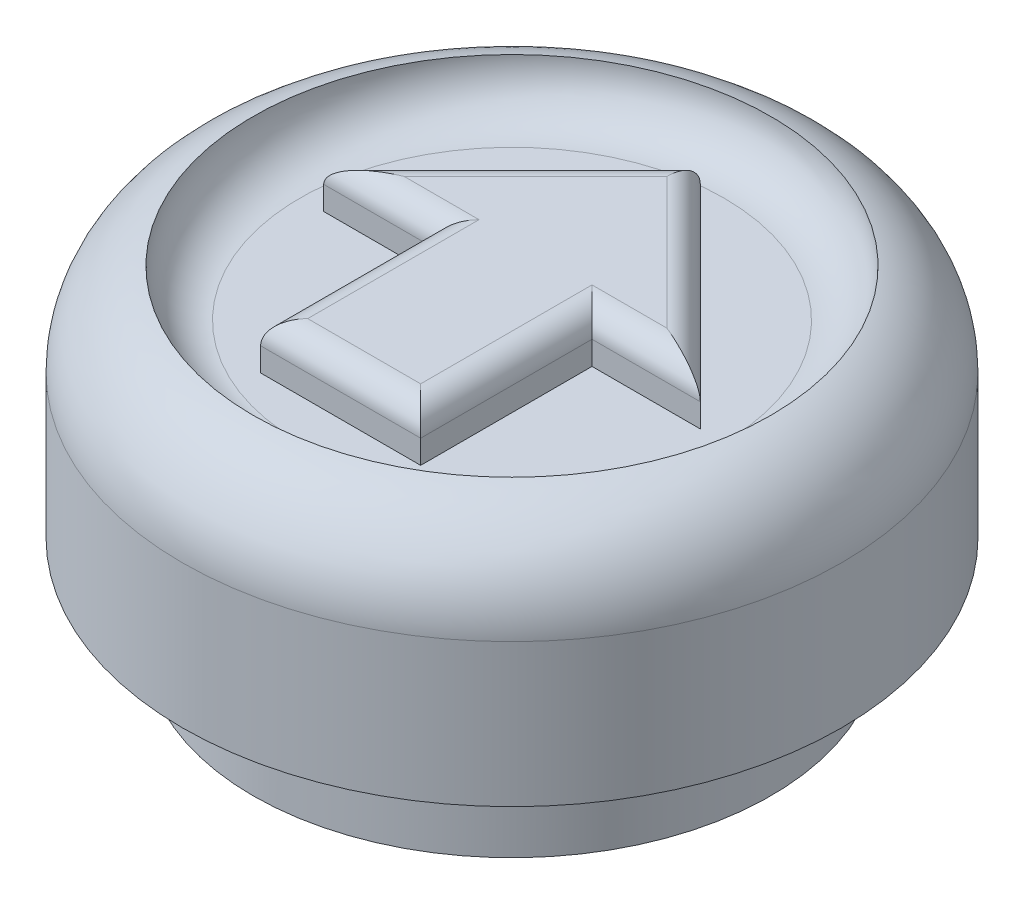
ISO-10303-21;
HEADER;
FILE_DESCRIPTION(('STEP AP214'),'2;1');
FILE_NAME('part.step','',(''),(''),'','','');
FILE_SCHEMA(('AUTOMOTIVE_DESIGN { 1 0 10303 214 1 1 1 1 }'));
ENDSEC;
DATA;
#1=APPLICATION_CONTEXT('core data for automotive mechanical design processes');
#2=APPLICATION_PROTOCOL_DEFINITION('international standard','automotive_design',2000,#1);
#3=PRODUCT_CONTEXT('',#1,'mechanical');
#4=PRODUCT('Part','Part','',(#3));
#5=PRODUCT_RELATED_PRODUCT_CATEGORY('part','',(#4));
#6=PRODUCT_DEFINITION_FORMATION('','',#4);
#7=PRODUCT_DEFINITION_CONTEXT('part definition',#1,'design');
#8=PRODUCT_DEFINITION('design','',#6,#7);
#9=PRODUCT_DEFINITION_SHAPE('','',#8);
#10=(LENGTH_UNIT() NAMED_UNIT(*) SI_UNIT(.MILLI.,.METRE.));
#11=(NAMED_UNIT(*) PLANE_ANGLE_UNIT() SI_UNIT($,.RADIAN.));
#12=(NAMED_UNIT(*) SI_UNIT($,.STERADIAN.) SOLID_ANGLE_UNIT());
#13=UNCERTAINTY_MEASURE_WITH_UNIT(LENGTH_MEASURE(1.E-05),#10,'distance_accuracy_value','');
#14=(GEOMETRIC_REPRESENTATION_CONTEXT(3) GLOBAL_UNCERTAINTY_ASSIGNED_CONTEXT((#13)) GLOBAL_UNIT_ASSIGNED_CONTEXT((#10,
#11,#12)) REPRESENTATION_CONTEXT('',''));
#15=CARTESIAN_POINT('',(0.,0.,0.));
#16=DIRECTION('',(0.,0.,1.));
#17=DIRECTION('',(1.,0.,0.));
#18=AXIS2_PLACEMENT_3D('',#15,#16,#17);
#19=CARTESIAN_POINT('',(0.,6.,0.));
#20=DIRECTION('',(0.,1.,0.));
#21=DIRECTION('',(0.,0.,1.));
#22=AXIS2_PLACEMENT_3D('',#19,#20,#21);
#23=PLANE('',#22);
#24=CARTESIAN_POINT('',(0.,6.,0.));
#25=DIRECTION('',(0.,1.,0.));
#26=DIRECTION('',(0.,0.,1.));
#27=AXIS2_PLACEMENT_3D('',#24,#25,#26);
#28=CIRCLE('',#27,4.5);
#29=CARTESIAN_POINT('',(0.,6.,4.5));
#30=VERTEX_POINT('',#29);
#31=EDGE_CURVE('E230',#30,#30,#28,.T.);
#32=ORIENTED_EDGE('',*,*,#31,.T.);
#33=EDGE_LOOP('',(#32));
#34=FACE_BOUND('',#33,.T.);
#35=DIRECTION('',(-0.707106781184056,0.,0.707106781189039));
#36=VECTOR('',#35,1.);
#37=CARTESIAN_POINT('',(0.,6.,-3.99999999999534));
#38=LINE('',#37,#36);
#39=CARTESIAN_POINT('',(0.,6.,-3.99999999999534));
#40=VERTEX_POINT('',#39);
#41=CARTESIAN_POINT('',(-3.99999999996716,6.,0.));
#42=VERTEX_POINT('',#41);
#43=EDGE_CURVE('E183',#40,#42,#38,.T.);
#44=ORIENTED_EDGE('',*,*,#43,.F.);
#45=DIRECTION('',(-0.707106781189039,0.,-0.707106781184056));
#46=VECTOR('',#45,1.);
#47=CARTESIAN_POINT('',(4.00000000002352,6.,0.));
#48=LINE('',#47,#46);
#49=CARTESIAN_POINT('',(4.00000000002352,6.,0.));
#50=VERTEX_POINT('',#49);
#51=EDGE_CURVE('E177',#50,#40,#48,.T.);
#52=ORIENTED_EDGE('',*,*,#51,.F.);
#53=DIRECTION('',(1.,0.,0.));
#54=VECTOR('',#53,1.);
#55=CARTESIAN_POINT('',(1.7,6.,0.));
#56=LINE('',#55,#54);
#57=CARTESIAN_POINT('',(1.7,6.,0.));
#58=VERTEX_POINT('',#57);
#59=EDGE_CURVE('E198',#58,#50,#56,.T.);
#60=ORIENTED_EDGE('',*,*,#59,.F.);
#61=DIRECTION('',(0.,0.,-1.));
#62=VECTOR('',#61,1.);
#63=CARTESIAN_POINT('',(1.7,6.,3.64010703583415));
#64=LINE('',#63,#62);
#65=CARTESIAN_POINT('',(1.7,6.,3.64010703583415));
#66=VERTEX_POINT('',#65);
#67=EDGE_CURVE('E195',#66,#58,#64,.T.);
#68=ORIENTED_EDGE('',*,*,#67,.F.);
#69=DIRECTION('',(1.,0.,0.));
#70=VECTOR('',#69,1.);
#71=CARTESIAN_POINT('',(-1.7,6.,3.64010703583417));
#72=LINE('',#71,#70);
#73=CARTESIAN_POINT('',(-1.7,6.,3.64010703583417));
#74=VERTEX_POINT('',#73);
#75=EDGE_CURVE('E192',#74,#66,#72,.T.);
#76=ORIENTED_EDGE('',*,*,#75,.F.);
#77=DIRECTION('',(0.,0.,1.));
#78=VECTOR('',#77,1.);
#79=CARTESIAN_POINT('',(-1.7,6.,0.));
#80=LINE('',#79,#78);
#81=CARTESIAN_POINT('',(-1.7,6.,0.));
#82=VERTEX_POINT('',#81);
#83=EDGE_CURVE('E189',#82,#74,#80,.T.);
#84=ORIENTED_EDGE('',*,*,#83,.F.);
#85=DIRECTION('',(1.,0.,0.));
#86=VECTOR('',#85,1.);
#87=CARTESIAN_POINT('',(-3.99999999996716,6.,0.));
#88=LINE('',#87,#86);
#89=EDGE_CURVE('E186',#42,#82,#88,.T.);
#90=ORIENTED_EDGE('',*,*,#89,.F.);
#91=EDGE_LOOP('',(#44,#52,#60,#68,#76,#84,#90));
#92=FACE_BOUND('',#91,.T.);
#93=ADVANCED_FACE('F33',(#34,#92),#23,.T.);
#94=CARTESIAN_POINT('',(0.,7.,0.));
#95=DIRECTION('',(0.,-1.,0.));
#96=DIRECTION('',(0.,0.,-1.));
#97=AXIS2_PLACEMENT_3D('',#94,#95,#96);
#98=CYLINDRICAL_SURFACE('',#97,5.5);
#99=CARTESIAN_POINT('',(0.,0.,0.));
#100=DIRECTION('',(0.,1.,0.));
#101=DIRECTION('',(0.,0.,1.));
#102=AXIS2_PLACEMENT_3D('',#99,#100,#101);
#103=CIRCLE('',#102,5.5);
#104=CARTESIAN_POINT('',(0.,0.,5.5));
#105=VERTEX_POINT('',#104);
#106=EDGE_CURVE('E224',#105,#105,#103,.T.);
#107=ORIENTED_EDGE('',*,*,#106,.T.);
#108=EDGE_LOOP('',(#107));
#109=FACE_BOUND('',#108,.T.);
#110=CARTESIAN_POINT('',(0.,2.00000000000002,0.));
#111=DIRECTION('',(0.,1.,0.));
#112=DIRECTION('',(-1.,0.,0.));
#113=AXIS2_PLACEMENT_3D('',#110,#111,#112);
#114=CIRCLE('',#113,5.5);
#115=CARTESIAN_POINT('',(-5.5,2.,0.));
#116=VERTEX_POINT('',#115);
#117=EDGE_CURVE('E227',#116,#116,#114,.T.);
#118=ORIENTED_EDGE('',*,*,#117,.F.);
#119=EDGE_LOOP('',(#118));
#120=FACE_BOUND('',#119,.T.);
#121=ADVANCED_FACE('F332',(#109,#120),#98,.T.);
#122=CARTESIAN_POINT('',(0.,0.,0.));
#123=DIRECTION('',(0.,1.,0.));
#124=DIRECTION('',(0.,0.,1.));
#125=AXIS2_PLACEMENT_3D('',#122,#123,#124);
#126=PLANE('',#125);
#127=DIRECTION('',(1.,0.,5.94468051171676E-13));
#128=VECTOR('',#127,1.);
#129=CARTESIAN_POINT('',(-2.00000000000628,0.,-2.00000000000715));
#130=LINE('',#129,#128);
#131=CARTESIAN_POINT('',(-2.00000000000628,0.,-2.00000000000715));
#132=VERTEX_POINT('',#131);
#133=CARTESIAN_POINT('',(2.00000000000803,0.,-2.00000000000477));
#134=VERTEX_POINT('',#133);
#135=EDGE_CURVE('E171',#132,#134,#130,.T.);
#136=ORIENTED_EDGE('',*,*,#135,.F.);
#137=DIRECTION('',(-8.11850586754725E-13,0.,-1.));
#138=VECTOR('',#137,1.);
#139=CARTESIAN_POINT('',(-2.00000000000628,0.,-2.00000000000715));
#140=LINE('',#139,#138);
#141=CARTESIAN_POINT('',(-2.00000000000303,0.,2.00000000000477));
#142=VERTEX_POINT('',#141);
#143=EDGE_CURVE('E145',#142,#132,#140,.T.);
#144=ORIENTED_EDGE('',*,*,#143,.F.);
#145=DIRECTION('',(-1.,0.,0.));
#146=VECTOR('',#145,1.);
#147=CARTESIAN_POINT('',(-2.00000000000303,0.,2.00000000000477));
#148=LINE('',#147,#146);
#149=CARTESIAN_POINT('',(2.00000000000652,0.,2.00000000000477));
#150=VERTEX_POINT('',#149);
#151=EDGE_CURVE('E162',#150,#142,#148,.T.);
#152=ORIENTED_EDGE('',*,*,#151,.F.);
#153=DIRECTION('',(-3.77085515589558E-13,0.,1.));
#154=VECTOR('',#153,1.);
#155=CARTESIAN_POINT('',(2.00000000000803,0.,-2.00000000000477));
#156=LINE('',#155,#154);
#157=EDGE_CURVE('E165',#134,#150,#156,.T.);
#158=ORIENTED_EDGE('',*,*,#157,.F.);
#159=EDGE_LOOP('',(#136,#144,#152,#158));
#160=FACE_BOUND('',#159,.T.);
#161=ORIENTED_EDGE('',*,*,#106,.F.);
#162=EDGE_LOOP('',(#161));
#163=FACE_BOUND('',#162,.T.);
#164=ADVANCED_FACE('F338',(#160,#163),#126,.F.);
#165=CARTESIAN_POINT('',(0.,5.03589838486559,0.));
#166=DIRECTION('',(0.,-1.,0.));
#167=DIRECTION('',(1.,0.,0.));
#168=AXIS2_PLACEMENT_3D('',#165,#166,#167);
#169=TOROIDAL_SURFACE('',#168,4.96410161513087,2.03589838486562);
#170=CARTESIAN_POINT('',(0.,5.0358983848704,0.));
#171=DIRECTION('',(0.,-1.,0.));
#172=DIRECTION('',(1.,0.,0.));
#173=AXIS2_PLACEMENT_3D('',#170,#171,#172);
#174=CIRCLE('',#173,6.99999999999649);
#175=CARTESIAN_POINT('',(6.99999999999647,5.03589838487042,0.));
#176=VERTEX_POINT('',#175);
#177=EDGE_CURVE('E218',#176,#176,#174,.T.);
#178=ORIENTED_EDGE('',*,*,#177,.F.);
#179=EDGE_LOOP('',(#178));
#180=FACE_BOUND('',#179,.T.);
#181=CARTESIAN_POINT('',(0.,7.,0.));
#182=DIRECTION('',(0.,1.,0.));
#183=DIRECTION('',(0.,0.,1.));
#184=AXIS2_PLACEMENT_3D('',#181,#182,#183);
#185=CIRCLE('',#184,5.5);
#186=CARTESIAN_POINT('',(0.,7.,5.5));
#187=VERTEX_POINT('',#186);
#188=EDGE_CURVE('E215',#187,#187,#185,.T.);
#189=ORIENTED_EDGE('',*,*,#188,.F.);
#190=EDGE_LOOP('',(#189));
#191=FACE_BOUND('',#190,.T.);
#192=ADVANCED_FACE('F352',(#180,#191),#169,.T.);
#193=CARTESIAN_POINT('',(-4.66523063482782,2.,0.));
#194=DIRECTION('',(0.,1.,0.));
#195=DIRECTION('',(-1.,0.,0.));
#196=AXIS2_PLACEMENT_3D('',#193,#194,#195);
#197=PLANE('',#196);
#198=ORIENTED_EDGE('',*,*,#117,.T.);
#199=EDGE_LOOP('',(#198));
#200=FACE_BOUND('',#199,.T.);
#201=CARTESIAN_POINT('',(0.,2.,0.));
#202=DIRECTION('',(0.,-1.,0.));
#203=DIRECTION('',(1.,0.,0.));
#204=AXIS2_PLACEMENT_3D('',#201,#202,#203);
#205=CIRCLE('',#204,7.00000000000075);
#206=CARTESIAN_POINT('',(7.00000000000074,2.00000000000003,0.));
#207=VERTEX_POINT('',#206);
#208=EDGE_CURVE('E221',#207,#207,#205,.T.);
#209=ORIENTED_EDGE('',*,*,#208,.T.);
#210=EDGE_LOOP('',(#209));
#211=FACE_BOUND('',#210,.T.);
#212=ADVANCED_FACE('F348',(#200,#211),#197,.F.);
#213=CARTESIAN_POINT('',(3.49148133884313E-12,-1000.,0.));
#214=DIRECTION('',(0.,-1.,0.));
#215=DIRECTION('',(1.,0.,0.));
#216=AXIS2_PLACEMENT_3D('',#213,#214,#215);
#217=CYLINDRICAL_SURFACE('',#216,6.99999999999862);
#218=ORIENTED_EDGE('',*,*,#208,.F.);
#219=EDGE_LOOP('',(#218));
#220=FACE_BOUND('',#219,.T.);
#221=ORIENTED_EDGE('',*,*,#177,.T.);
#222=EDGE_LOOP('',(#221));
#223=FACE_BOUND('',#222,.T.);
#224=ADVANCED_FACE('F345',(#220,#223),#217,.T.);
#225=CARTESIAN_POINT('',(4.00000000002352,7.,0.));
#226=DIRECTION('',(-0.707106781184056,0.,0.707106781189039));
#227=DIRECTION('',(0.707106781189039,0.,0.707106781184056));
#228=AXIS2_PLACEMENT_3D('',#225,#226,#227);
#229=PLANE('',#228);
#230=DIRECTION('',(0.,-1.,0.));
#231=VECTOR('',#230,1.);
#232=CARTESIAN_POINT('',(0.,7.,-3.99999999999534));
#233=LINE('',#232,#231);
#234=CARTESIAN_POINT('',(0.,6.5,-3.99999999999534));
#235=VERTEX_POINT('',#234);
#236=EDGE_CURVE('E213',#235,#40,#233,.T.);
#237=ORIENTED_EDGE('',*,*,#236,.F.);
#238=DIRECTION('',(-0.707106781189039,0.,-0.707106781184056));
#239=VECTOR('',#238,1.);
#240=CARTESIAN_POINT('',(4.00000000002352,6.5,0.));
#241=LINE('',#240,#239);
#242=CARTESIAN_POINT('',(4.00000000002352,6.5,0.));
#243=VERTEX_POINT('',#242);
#244=EDGE_CURVE('E253',#235,#243,#241,.F.);
#245=ORIENTED_EDGE('',*,*,#244,.T.);
#246=DIRECTION('',(0.,-1.,0.));
#247=VECTOR('',#246,1.);
#248=CARTESIAN_POINT('',(4.00000000002352,7.,0.));
#249=LINE('',#248,#247);
#250=EDGE_CURVE('E201',#243,#50,#249,.T.);
#251=ORIENTED_EDGE('',*,*,#250,.T.);
#252=ORIENTED_EDGE('',*,*,#51,.T.);
#253=EDGE_LOOP('',(#237,#245,#251,#252));
#254=FACE_BOUND('',#253,.T.);
#255=ADVANCED_FACE('F319',(#254),#229,.F.);
#256=CARTESIAN_POINT('',(0.,7.,-3.99999999999534));
#257=DIRECTION('',(0.707106781189039,0.,0.707106781184056));
#258=DIRECTION('',(0.707106781184056,0.,-0.707106781189039));
#259=AXIS2_PLACEMENT_3D('',#256,#257,#258);
#260=PLANE('',#259);
#261=DIRECTION('',(0.,-1.,0.));
#262=VECTOR('',#261,1.);
#263=CARTESIAN_POINT('',(-3.99999999996716,7.,0.));
#264=LINE('',#263,#262);
#265=CARTESIAN_POINT('',(-3.99999999996716,6.5,0.));
#266=VERTEX_POINT('',#265);
#267=EDGE_CURVE('E211',#266,#42,#264,.T.);
#268=ORIENTED_EDGE('',*,*,#267,.F.);
#269=DIRECTION('',(-0.707106781184056,0.,0.707106781189039));
#270=VECTOR('',#269,1.);
#271=CARTESIAN_POINT('',(0.,6.5,-3.99999999999534));
#272=LINE('',#271,#270);
#273=EDGE_CURVE('E251',#266,#235,#272,.F.);
#274=ORIENTED_EDGE('',*,*,#273,.T.);
#275=ORIENTED_EDGE('',*,*,#236,.T.);
#276=ORIENTED_EDGE('',*,*,#43,.T.);
#277=EDGE_LOOP('',(#268,#274,#275,#276));
#278=FACE_BOUND('',#277,.T.);
#279=ADVANCED_FACE('F317',(#278),#260,.F.);
#280=CARTESIAN_POINT('',(-3.99999999996716,7.,0.));
#281=DIRECTION('',(0.,0.,-1.));
#282=DIRECTION('',(-1.,0.,0.));
#283=AXIS2_PLACEMENT_3D('',#280,#281,#282);
#284=PLANE('',#283);
#285=DIRECTION('',(0.,-1.,0.));
#286=VECTOR('',#285,1.);
#287=CARTESIAN_POINT('',(-1.7,7.,0.));
#288=LINE('',#287,#286);
#289=CARTESIAN_POINT('',(-1.7,6.5,0.));
#290=VERTEX_POINT('',#289);
#291=EDGE_CURVE('E209',#290,#82,#288,.T.);
#292=ORIENTED_EDGE('',*,*,#291,.F.);
#293=DIRECTION('',(1.,0.,0.));
#294=VECTOR('',#293,1.);
#295=CARTESIAN_POINT('',(-3.99999999996716,6.5,0.));
#296=LINE('',#295,#294);
#297=EDGE_CURVE('E248',#290,#266,#296,.F.);
#298=ORIENTED_EDGE('',*,*,#297,.T.);
#299=ORIENTED_EDGE('',*,*,#267,.T.);
#300=ORIENTED_EDGE('',*,*,#89,.T.);
#301=EDGE_LOOP('',(#292,#298,#299,#300));
#302=FACE_BOUND('',#301,.T.);
#303=ADVANCED_FACE('F303',(#302),#284,.F.);
#304=CARTESIAN_POINT('',(-1.7,7.,0.));
#305=DIRECTION('',(1.,0.,0.));
#306=DIRECTION('',(0.,0.,-1.));
#307=AXIS2_PLACEMENT_3D('',#304,#305,#306);
#308=PLANE('',#307);
#309=DIRECTION('',(0.,-1.,0.));
#310=VECTOR('',#309,1.);
#311=CARTESIAN_POINT('',(-1.7,7.,3.64010703583417));
#312=LINE('',#311,#310);
#313=CARTESIAN_POINT('',(-1.7,6.5,3.64010703583417));
#314=VERTEX_POINT('',#313);
#315=EDGE_CURVE('E207',#314,#74,#312,.T.);
#316=ORIENTED_EDGE('',*,*,#315,.F.);
#317=DIRECTION('',(0.,0.,1.));
#318=VECTOR('',#317,1.);
#319=CARTESIAN_POINT('',(-1.7,6.5,0.));
#320=LINE('',#319,#318);
#321=EDGE_CURVE('E11',#314,#290,#320,.F.);
#322=ORIENTED_EDGE('',*,*,#321,.T.);
#323=ORIENTED_EDGE('',*,*,#291,.T.);
#324=ORIENTED_EDGE('',*,*,#83,.T.);
#325=EDGE_LOOP('',(#316,#322,#323,#324));
#326=FACE_BOUND('',#325,.T.);
#327=ADVANCED_FACE('F300',(#326),#308,.F.);
#328=CARTESIAN_POINT('',(-1.7,7.,3.64010703583417));
#329=DIRECTION('',(0.,0.,-1.));
#330=DIRECTION('',(-1.,0.,0.));
#331=AXIS2_PLACEMENT_3D('',#328,#329,#330);
#332=PLANE('',#331);
#333=DIRECTION('',(0.,-1.,0.));
#334=VECTOR('',#333,1.);
#335=CARTESIAN_POINT('',(1.7,7.,3.64010703583415));
#336=LINE('',#335,#334);
#337=CARTESIAN_POINT('',(1.7,6.5,3.64010703583415));
#338=VERTEX_POINT('',#337);
#339=EDGE_CURVE('E205',#338,#66,#336,.T.);
#340=ORIENTED_EDGE('',*,*,#339,.F.);
#341=DIRECTION('',(1.,0.,0.));
#342=VECTOR('',#341,1.);
#343=CARTESIAN_POINT('',(-1.7,6.5,3.64010703583417));
#344=LINE('',#343,#342);
#345=EDGE_CURVE('E42',#338,#314,#344,.F.);
#346=ORIENTED_EDGE('',*,*,#345,.T.);
#347=ORIENTED_EDGE('',*,*,#315,.T.);
#348=ORIENTED_EDGE('',*,*,#75,.T.);
#349=EDGE_LOOP('',(#340,#346,#347,#348));
#350=FACE_BOUND('',#349,.T.);
#351=ADVANCED_FACE('F464',(#350),#332,.F.);
#352=CARTESIAN_POINT('',(1.7,7.,3.64010703583415));
#353=DIRECTION('',(-1.,0.,0.));
#354=DIRECTION('',(0.,0.,1.));
#355=AXIS2_PLACEMENT_3D('',#352,#353,#354);
#356=PLANE('',#355);
#357=DIRECTION('',(0.,-1.,0.));
#358=VECTOR('',#357,1.);
#359=CARTESIAN_POINT('',(1.7,7.,0.));
#360=LINE('',#359,#358);
#361=CARTESIAN_POINT('',(1.7,6.5,0.));
#362=VERTEX_POINT('',#361);
#363=EDGE_CURVE('E203',#362,#58,#360,.T.);
#364=ORIENTED_EDGE('',*,*,#363,.F.);
#365=DIRECTION('',(0.,0.,-1.));
#366=VECTOR('',#365,1.);
#367=CARTESIAN_POINT('',(1.7,6.5,3.64010703583415));
#368=LINE('',#367,#366);
#369=EDGE_CURVE('E57',#362,#338,#368,.F.);
#370=ORIENTED_EDGE('',*,*,#369,.T.);
#371=ORIENTED_EDGE('',*,*,#339,.T.);
#372=ORIENTED_EDGE('',*,*,#67,.T.);
#373=EDGE_LOOP('',(#364,#370,#371,#372));
#374=FACE_BOUND('',#373,.T.);
#375=ADVANCED_FACE('F472',(#374),#356,.F.);
#376=CARTESIAN_POINT('',(1.7,7.,0.));
#377=DIRECTION('',(0.,0.,-1.));
#378=DIRECTION('',(-1.,0.,0.));
#379=AXIS2_PLACEMENT_3D('',#376,#377,#378);
#380=PLANE('',#379);
#381=ORIENTED_EDGE('',*,*,#250,.F.);
#382=DIRECTION('',(1.,0.,0.));
#383=VECTOR('',#382,1.);
#384=CARTESIAN_POINT('',(1.7,6.5,0.));
#385=LINE('',#384,#383);
#386=EDGE_CURVE('E255',#243,#362,#385,.F.);
#387=ORIENTED_EDGE('',*,*,#386,.T.);
#388=ORIENTED_EDGE('',*,*,#363,.T.);
#389=ORIENTED_EDGE('',*,*,#59,.T.);
#390=EDGE_LOOP('',(#381,#387,#388,#389));
#391=FACE_BOUND('',#390,.T.);
#392=ADVANCED_FACE('F480',(#391),#380,.F.);
#393=CARTESIAN_POINT('',(0.,7.,0.));
#394=DIRECTION('',(0.,1.,0.));
#395=DIRECTION('',(0.,0.,1.));
#396=AXIS2_PLACEMENT_3D('',#393,#394,#395);
#397=PLANE('',#396);
#398=DIRECTION('',(-0.707106781184056,0.,0.707106781189039));
#399=VECTOR('',#398,1.);
#400=CARTESIAN_POINT('',(-3.64644660937264,7.,0.353553390592029));
#401=LINE('',#400,#399);
#402=CARTESIAN_POINT('',(2.48417379231164E-12,7.,-3.29289321880879));
#403=VERTEX_POINT('',#402);
#404=CARTESIAN_POINT('',(-2.79289321878663,7.,-0.5));
#405=VERTEX_POINT('',#404);
#406=EDGE_CURVE('E243',#403,#405,#401,.T.);
#407=ORIENTED_EDGE('',*,*,#406,.T.);
#408=DIRECTION('',(1.,0.,0.));
#409=VECTOR('',#408,1.);
#410=CARTESIAN_POINT('',(-1.7,7.,-0.5));
#411=LINE('',#410,#409);
#412=CARTESIAN_POINT('',(-1.2,7.,-0.5));
#413=VERTEX_POINT('',#412);
#414=EDGE_CURVE('E245',#405,#413,#411,.T.);
#415=ORIENTED_EDGE('',*,*,#414,.T.);
#416=DIRECTION('',(0.,0.,1.));
#417=VECTOR('',#416,1.);
#418=CARTESIAN_POINT('',(-1.2,7.,3.64010703583417));
#419=LINE('',#418,#417);
#420=CARTESIAN_POINT('',(-1.2,7.,3.14010703583417));
#421=VERTEX_POINT('',#420);
#422=EDGE_CURVE('E233',#413,#421,#419,.T.);
#423=ORIENTED_EDGE('',*,*,#422,.T.);
#424=DIRECTION('',(1.,0.,0.));
#425=VECTOR('',#424,1.);
#426=CARTESIAN_POINT('',(1.7,7.,3.14010703583415));
#427=LINE('',#426,#425);
#428=CARTESIAN_POINT('',(1.2,7.,3.14010703583415));
#429=VERTEX_POINT('',#428);
#430=EDGE_CURVE('E235',#421,#429,#427,.T.);
#431=ORIENTED_EDGE('',*,*,#430,.T.);
#432=DIRECTION('',(0.,0.,-1.));
#433=VECTOR('',#432,1.);
#434=CARTESIAN_POINT('',(1.2,7.,0.));
#435=LINE('',#434,#433);
#436=CARTESIAN_POINT('',(1.2,7.,-0.5));
#437=VERTEX_POINT('',#436);
#438=EDGE_CURVE('E237',#429,#437,#435,.T.);
#439=ORIENTED_EDGE('',*,*,#438,.T.);
#440=DIRECTION('',(1.,0.,0.));
#441=VECTOR('',#440,1.);
#442=CARTESIAN_POINT('',(4.00000000002352,7.,-0.5));
#443=LINE('',#442,#441);
#444=CARTESIAN_POINT('',(2.79289321883095,7.,-0.5));
#445=VERTEX_POINT('',#444);
#446=EDGE_CURVE('E239',#437,#445,#443,.T.);
#447=ORIENTED_EDGE('',*,*,#446,.T.);
#448=DIRECTION('',(-0.707106781189039,0.,-0.707106781184056));
#449=VECTOR('',#448,1.);
#450=CARTESIAN_POINT('',(-0.353553390592035,7.,-3.64644660940082));
#451=LINE('',#450,#449);
#452=EDGE_CURVE('E241',#445,#403,#451,.T.);
#453=ORIENTED_EDGE('',*,*,#452,.T.);
#454=EDGE_LOOP('',(#407,#415,#423,#431,#439,#447,#453));
#455=FACE_BOUND('',#454,.T.);
#456=ADVANCED_FACE('F287',(#455),#397,.T.);
#457=CARTESIAN_POINT('',(-2.00000000000628,3.,-2.00000000000715));
#458=DIRECTION('',(-1.,0.,8.11850586754725E-13));
#459=DIRECTION('',(8.11850586754725E-13,0.,1.));
#460=AXIS2_PLACEMENT_3D('',#457,#458,#459);
#461=PLANE('',#460);
#462=ORIENTED_EDGE('',*,*,#143,.T.);
#463=DIRECTION('',(0.,-1.,0.));
#464=VECTOR('',#463,1.);
#465=CARTESIAN_POINT('',(-2.00000000000628,3.,-2.00000000000715));
#466=LINE('',#465,#464);
#467=CARTESIAN_POINT('',(-2.00000000000628,3.,-2.00000000000715));
#468=VERTEX_POINT('',#467);
#469=EDGE_CURVE('E138',#468,#132,#466,.T.);
#470=ORIENTED_EDGE('',*,*,#469,.F.);
#471=DIRECTION('',(-8.11850586754725E-13,0.,-1.));
#472=VECTOR('',#471,1.);
#473=CARTESIAN_POINT('',(-2.00000000000628,3.,-2.00000000000715));
#474=LINE('',#473,#472);
#475=CARTESIAN_POINT('',(-2.00000000000303,3.,2.00000000000477));
#476=VERTEX_POINT('',#475);
#477=EDGE_CURVE('E142',#476,#468,#474,.T.);
#478=ORIENTED_EDGE('',*,*,#477,.F.);
#479=DIRECTION('',(0.,-1.,0.));
#480=VECTOR('',#479,1.);
#481=CARTESIAN_POINT('',(-2.00000000000303,3.,2.00000000000477));
#482=LINE('',#481,#480);
#483=EDGE_CURVE('E175',#476,#142,#482,.T.);
#484=ORIENTED_EDGE('',*,*,#483,.T.);
#485=EDGE_LOOP('',(#462,#470,#478,#484));
#486=FACE_BOUND('',#485,.T.);
#487=ADVANCED_FACE('F140',(#486),#461,.F.);
#488=CARTESIAN_POINT('',(-2.00000000000303,3.,2.00000000000477));
#489=DIRECTION('',(0.,0.,1.));
#490=DIRECTION('',(1.,0.,0.));
#491=AXIS2_PLACEMENT_3D('',#488,#489,#490);
#492=PLANE('',#491);
#493=ORIENTED_EDGE('',*,*,#151,.T.);
#494=ORIENTED_EDGE('',*,*,#483,.F.);
#495=DIRECTION('',(-1.,0.,0.));
#496=VECTOR('',#495,1.);
#497=CARTESIAN_POINT('',(-2.00000000000303,3.,2.00000000000477));
#498=LINE('',#497,#496);
#499=CARTESIAN_POINT('',(2.00000000000652,3.,2.00000000000477));
#500=VERTEX_POINT('',#499);
#501=EDGE_CURVE('E150',#500,#476,#498,.T.);
#502=ORIENTED_EDGE('',*,*,#501,.F.);
#503=DIRECTION('',(0.,-1.,0.));
#504=VECTOR('',#503,1.);
#505=CARTESIAN_POINT('',(2.00000000000652,3.,2.00000000000477));
#506=LINE('',#505,#504);
#507=EDGE_CURVE('E178',#500,#150,#506,.T.);
#508=ORIENTED_EDGE('',*,*,#507,.T.);
#509=EDGE_LOOP('',(#493,#494,#502,#508));
#510=FACE_BOUND('',#509,.T.);
#511=ADVANCED_FACE('F502',(#510),#492,.F.);
#512=CARTESIAN_POINT('',(2.00000000000803,3.,-2.00000000000477));
#513=DIRECTION('',(1.,0.,3.77085515589558E-13));
#514=DIRECTION('',(3.77085515589558E-13,0.,-1.));
#515=AXIS2_PLACEMENT_3D('',#512,#513,#514);
#516=PLANE('',#515);
#517=ORIENTED_EDGE('',*,*,#157,.T.);
#518=ORIENTED_EDGE('',*,*,#507,.F.);
#519=DIRECTION('',(-3.77085515589558E-13,0.,1.));
#520=VECTOR('',#519,1.);
#521=CARTESIAN_POINT('',(2.00000000000803,3.,-2.00000000000477));
#522=LINE('',#521,#520);
#523=CARTESIAN_POINT('',(2.00000000000803,3.,-2.00000000000477));
#524=VERTEX_POINT('',#523);
#525=EDGE_CURVE('E158',#524,#500,#522,.T.);
#526=ORIENTED_EDGE('',*,*,#525,.F.);
#527=DIRECTION('',(0.,-1.,0.));
#528=VECTOR('',#527,1.);
#529=CARTESIAN_POINT('',(2.00000000000803,3.,-2.00000000000477));
#530=LINE('',#529,#528);
#531=EDGE_CURVE('E149',#524,#134,#530,.T.);
#532=ORIENTED_EDGE('',*,*,#531,.T.);
#533=EDGE_LOOP('',(#517,#518,#526,#532));
#534=FACE_BOUND('',#533,.T.);
#535=ADVANCED_FACE('F511',(#534),#516,.F.);
#536=CARTESIAN_POINT('',(-2.00000000000628,3.,-2.00000000000715));
#537=DIRECTION('',(5.94468051171676E-13,0.,-1.));
#538=DIRECTION('',(-1.,0.,-5.94468051171676E-13));
#539=AXIS2_PLACEMENT_3D('',#536,#537,#538);
#540=PLANE('',#539);
#541=ORIENTED_EDGE('',*,*,#135,.T.);
#542=ORIENTED_EDGE('',*,*,#531,.F.);
#543=DIRECTION('',(1.,0.,5.94468051171676E-13));
#544=VECTOR('',#543,1.);
#545=CARTESIAN_POINT('',(-2.00000000000628,3.,-2.00000000000715));
#546=LINE('',#545,#544);
#547=EDGE_CURVE('E153',#468,#524,#546,.T.);
#548=ORIENTED_EDGE('',*,*,#547,.F.);
#549=ORIENTED_EDGE('',*,*,#469,.T.);
#550=EDGE_LOOP('',(#541,#542,#548,#549));
#551=FACE_BOUND('',#550,.T.);
#552=ADVANCED_FACE('F154',(#551),#540,.F.);
#553=CARTESIAN_POINT('',(0.,3.,0.));
#554=DIRECTION('',(0.,1.,0.));
#555=DIRECTION('',(0.,0.,1.));
#556=AXIS2_PLACEMENT_3D('',#553,#554,#555);
#557=PLANE('',#556);
#558=ORIENTED_EDGE('',*,*,#477,.T.);
#559=ORIENTED_EDGE('',*,*,#547,.T.);
#560=ORIENTED_EDGE('',*,*,#525,.T.);
#561=ORIENTED_EDGE('',*,*,#501,.T.);
#562=EDGE_LOOP('',(#558,#559,#560,#561));
#563=FACE_BOUND('',#562,.T.);
#564=ADVANCED_FACE('F160',(#563),#557,.F.);
#565=CARTESIAN_POINT('',(0.,7.,0.));
#566=DIRECTION('',(0.,1.,0.));
#567=DIRECTION('',(0.,0.,1.));
#568=AXIS2_PLACEMENT_3D('',#565,#566,#567);
#569=TOROIDAL_SURFACE('',#568,4.5,1.);
#570=ORIENTED_EDGE('',*,*,#188,.T.);
#571=EDGE_LOOP('',(#570));
#572=FACE_BOUND('',#571,.T.);
#573=ORIENTED_EDGE('',*,*,#31,.F.);
#574=EDGE_LOOP('',(#573));
#575=FACE_BOUND('',#574,.T.);
#576=ADVANCED_FACE('F360',(#572,#575),#569,.F.);
#577=CARTESIAN_POINT('',(0.,6.5,-0.5));
#578=DIRECTION('',(-1.,0.,0.));
#579=DIRECTION('',(0.,0.,1.));
#580=AXIS2_PLACEMENT_3D('',#577,#578,#579);
#581=CYLINDRICAL_SURFACE('',#580,0.5);
#582=CARTESIAN_POINT('',(2.79289321883095,6.5,-0.5));
#583=DIRECTION('',(-0.382683432363462,0.,0.923879532511961));
#584=DIRECTION('',(-0.923879532511961,0.,-0.382683432363462));
#585=AXIS2_PLACEMENT_3D('',#582,#583,#584);
#586=ELLIPSE('',#585,1.30656296488193,0.5);
#587=EDGE_CURVE('E271',#445,#243,#586,.F.);
#588=ORIENTED_EDGE('',*,*,#587,.F.);
#589=ORIENTED_EDGE('',*,*,#446,.F.);
#590=CARTESIAN_POINT('',(1.2,6.5,-0.5));
#591=DIRECTION('',(-0.707106781186547,0.,0.707106781186547));
#592=DIRECTION('',(-0.707106781186547,0.,-0.707106781186547));
#593=AXIS2_PLACEMENT_3D('',#590,#591,#592);
#594=ELLIPSE('',#593,0.707106781186547,0.5);
#595=EDGE_CURVE('E37',#362,#437,#594,.T.);
#596=ORIENTED_EDGE('',*,*,#595,.F.);
#597=ORIENTED_EDGE('',*,*,#386,.F.);
#598=EDGE_LOOP('',(#588,#589,#596,#597));
#599=FACE_BOUND('',#598,.T.);
#600=ADVANCED_FACE('F35',(#599),#581,.T.);
#601=CARTESIAN_POINT('',(1.2,6.5,0.));
#602=DIRECTION('',(0.,0.,1.));
#603=DIRECTION('',(1.,0.,0.));
#604=AXIS2_PLACEMENT_3D('',#601,#602,#603);
#605=CYLINDRICAL_SURFACE('',#604,0.5);
#606=ORIENTED_EDGE('',*,*,#595,.T.);
#607=ORIENTED_EDGE('',*,*,#438,.F.);
#608=CARTESIAN_POINT('',(1.2,6.5,3.14010703583415));
#609=DIRECTION('',(-0.707106781186545,0.,0.70710678118655));
#610=DIRECTION('',(-0.70710678118655,0.,-0.707106781186545));
#611=AXIS2_PLACEMENT_3D('',#608,#609,#610);
#612=ELLIPSE('',#611,0.707106781186545,0.5);
#613=EDGE_CURVE('E269',#338,#429,#612,.T.);
#614=ORIENTED_EDGE('',*,*,#613,.F.);
#615=ORIENTED_EDGE('',*,*,#369,.F.);
#616=EDGE_LOOP('',(#606,#607,#614,#615));
#617=FACE_BOUND('',#616,.T.);
#618=ADVANCED_FACE('F281',(#617),#605,.T.);
#619=CARTESIAN_POINT('',(1.64644660940564,6.5,-1.64644660941724));
#620=DIRECTION('',(0.707106781189039,0.,0.707106781184056));
#621=DIRECTION('',(0.707106781184056,0.,-0.707106781189039));
#622=AXIS2_PLACEMENT_3D('',#619,#620,#621);
#623=CYLINDRICAL_SURFACE('',#622,0.5);
#624=ORIENTED_EDGE('',*,*,#587,.T.);
#625=ORIENTED_EDGE('',*,*,#244,.F.);
#626=CARTESIAN_POINT('',(2.48401559738154E-12,6.5,-3.29289321880879));
#627=DIRECTION('',(1.,0.,-3.52305196341759E-12));
#628=DIRECTION('',(3.52305196341759E-12,0.,1.));
#629=AXIS2_PLACEMENT_3D('',#626,#627,#628);
#630=ELLIPSE('',#629,0.707106781186547,0.5);
#631=EDGE_CURVE('E266',#403,#235,#630,.F.);
#632=ORIENTED_EDGE('',*,*,#631,.F.);
#633=ORIENTED_EDGE('',*,*,#452,.F.);
#634=EDGE_LOOP('',(#624,#625,#632,#633));
#635=FACE_BOUND('',#634,.T.);
#636=ADVANCED_FACE('F323',(#635),#623,.T.);
#637=CARTESIAN_POINT('',(0.,6.5,3.14010703583416));
#638=DIRECTION('',(-1.,0.,0.));
#639=DIRECTION('',(0.,0.,1.));
#640=AXIS2_PLACEMENT_3D('',#637,#638,#639);
#641=CYLINDRICAL_SURFACE('',#640,0.5);
#642=ORIENTED_EDGE('',*,*,#613,.T.);
#643=ORIENTED_EDGE('',*,*,#430,.F.);
#644=CARTESIAN_POINT('',(-1.2,6.5,3.14010703583417));
#645=DIRECTION('',(-0.70710678118655,0.,-0.707106781186545));
#646=DIRECTION('',(0.707106781186545,0.,-0.70710678118655));
#647=AXIS2_PLACEMENT_3D('',#644,#645,#646);
#648=ELLIPSE('',#647,0.70710678118655,0.5);
#649=EDGE_CURVE('E263',#314,#421,#648,.T.);
#650=ORIENTED_EDGE('',*,*,#649,.F.);
#651=ORIENTED_EDGE('',*,*,#345,.F.);
#652=EDGE_LOOP('',(#642,#643,#650,#651));
#653=FACE_BOUND('',#652,.T.);
#654=ADVANCED_FACE('F293',(#653),#641,.T.);
#655=CARTESIAN_POINT('',(-1.64644660940315,6.5,-1.64644660939155));
#656=DIRECTION('',(0.707106781184056,0.,-0.707106781189039));
#657=DIRECTION('',(-0.707106781189039,0.,-0.707106781184056));
#658=AXIS2_PLACEMENT_3D('',#655,#656,#657);
#659=CYLINDRICAL_SURFACE('',#658,0.5);
#660=ORIENTED_EDGE('',*,*,#631,.T.);
#661=ORIENTED_EDGE('',*,*,#273,.F.);
#662=CARTESIAN_POINT('',(-2.79289321878663,6.5,-0.5));
#663=DIRECTION('',(-0.382683432366717,0.,-0.923879532510613));
#664=DIRECTION('',(0.923879532510613,0.,-0.382683432366717));
#665=AXIS2_PLACEMENT_3D('',#662,#663,#664);
#666=ELLIPSE('',#665,1.30656296487082,0.5);
#667=EDGE_CURVE('E261',#405,#266,#666,.F.);
#668=ORIENTED_EDGE('',*,*,#667,.F.);
#669=ORIENTED_EDGE('',*,*,#406,.F.);
#670=EDGE_LOOP('',(#660,#661,#668,#669));
#671=FACE_BOUND('',#670,.T.);
#672=ADVANCED_FACE('F314',(#671),#659,.T.);
#673=CARTESIAN_POINT('',(-1.2,6.5,0.));
#674=DIRECTION('',(0.,0.,-1.));
#675=DIRECTION('',(-1.,0.,0.));
#676=AXIS2_PLACEMENT_3D('',#673,#674,#675);
#677=CYLINDRICAL_SURFACE('',#676,0.5);
#678=ORIENTED_EDGE('',*,*,#649,.T.);
#679=ORIENTED_EDGE('',*,*,#422,.F.);
#680=CARTESIAN_POINT('',(-1.2,6.5,-0.5));
#681=DIRECTION('',(-0.707106781186547,0.,-0.707106781186547));
#682=DIRECTION('',(-0.707106781186547,0.,0.707106781186548));
#683=AXIS2_PLACEMENT_3D('',#680,#681,#682);
#684=ELLIPSE('',#683,0.707106781186547,0.5);
#685=EDGE_CURVE('E259',#290,#413,#684,.T.);
#686=ORIENTED_EDGE('',*,*,#685,.F.);
#687=ORIENTED_EDGE('',*,*,#321,.F.);
#688=EDGE_LOOP('',(#678,#679,#686,#687));
#689=FACE_BOUND('',#688,.T.);
#690=ADVANCED_FACE('F296',(#689),#677,.T.);
#691=CARTESIAN_POINT('',(0.,6.5,-0.5));
#692=DIRECTION('',(-1.,0.,0.));
#693=DIRECTION('',(0.,0.,1.));
#694=AXIS2_PLACEMENT_3D('',#691,#692,#693);
#695=CYLINDRICAL_SURFACE('',#694,0.5);
#696=ORIENTED_EDGE('',*,*,#667,.T.);
#697=ORIENTED_EDGE('',*,*,#297,.F.);
#698=ORIENTED_EDGE('',*,*,#685,.T.);
#699=ORIENTED_EDGE('',*,*,#414,.F.);
#700=EDGE_LOOP('',(#696,#697,#698,#699));
#701=FACE_BOUND('',#700,.T.);
#702=ADVANCED_FACE('F308',(#701),#695,.T.);
#703=CLOSED_SHELL('',(#93,#121,#164,#192,#212,#224,#255,#279,#303,#327,#351,#375,#392,#456,#487,
#511,#535,#552,#564,#576,#600,#618,#636,#654,#672,#690,#702));
#704=MANIFOLD_SOLID_BREP('B2',#703);
#705=ADVANCED_BREP_SHAPE_REPRESENTATION('',(#18,#704),#14);
#706=SHAPE_DEFINITION_REPRESENTATION(#9,#705);
ENDSEC;
END-ISO-10303-21;
